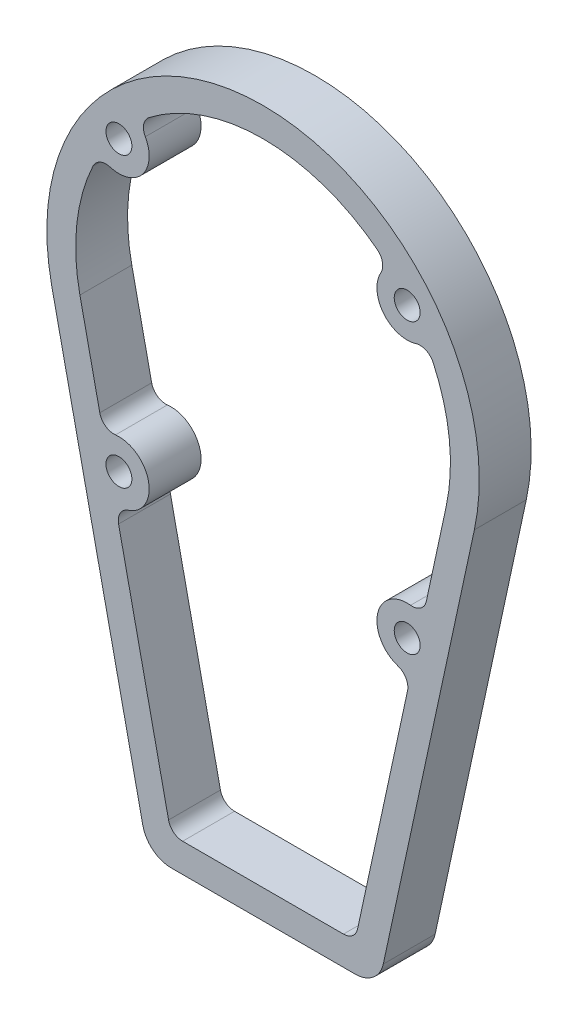
ISO-10303-21;
HEADER;
FILE_DESCRIPTION(('STEP AP214'),'2;1');
FILE_NAME('part.step','',(''),(''),'','','');
FILE_SCHEMA(('AUTOMOTIVE_DESIGN { 1 0 10303 214 1 1 1 1 }'));
ENDSEC;
DATA;
#1=APPLICATION_CONTEXT('core data for automotive mechanical design processes');
#2=APPLICATION_PROTOCOL_DEFINITION('international standard','automotive_design',2000,#1);
#3=PRODUCT_CONTEXT('',#1,'mechanical');
#4=PRODUCT('Part','Part','',(#3));
#5=PRODUCT_RELATED_PRODUCT_CATEGORY('part','',(#4));
#6=PRODUCT_DEFINITION_FORMATION('','',#4);
#7=PRODUCT_DEFINITION_CONTEXT('part definition',#1,'design');
#8=PRODUCT_DEFINITION('design','',#6,#7);
#9=PRODUCT_DEFINITION_SHAPE('','',#8);
#10=(LENGTH_UNIT() NAMED_UNIT(*) SI_UNIT(.MILLI.,.METRE.));
#11=(NAMED_UNIT(*) PLANE_ANGLE_UNIT() SI_UNIT($,.RADIAN.));
#12=(NAMED_UNIT(*) SI_UNIT($,.STERADIAN.) SOLID_ANGLE_UNIT());
#13=UNCERTAINTY_MEASURE_WITH_UNIT(LENGTH_MEASURE(1.E-05),#10,'distance_accuracy_value','');
#14=(GEOMETRIC_REPRESENTATION_CONTEXT(3) GLOBAL_UNCERTAINTY_ASSIGNED_CONTEXT((#13)) GLOBAL_UNIT_ASSIGNED_CONTEXT((#10,
#11,#12)) REPRESENTATION_CONTEXT('',''));
#15=CARTESIAN_POINT('',(0.,0.,0.));
#16=DIRECTION('',(0.,0.,1.));
#17=DIRECTION('',(1.,0.,0.));
#18=AXIS2_PLACEMENT_3D('',#15,#16,#17);
#19=CARTESIAN_POINT('',(0.,47.5,0.));
#20=DIRECTION('',(0.,0.,1.));
#21=DIRECTION('',(1.,0.,0.));
#22=AXIS2_PLACEMENT_3D('',#19,#20,#21);
#23=CYLINDRICAL_SURFACE('',#22,75.);
#24=CARTESIAN_POINT('',(0.,47.5,18.));
#25=DIRECTION('',(0.,0.,1.));
#26=DIRECTION('',(1.,0.,0.));
#27=AXIS2_PLACEMENT_3D('',#24,#25,#26);
#28=CIRCLE('',#27,75.);
#29=CARTESIAN_POINT('',(73.3083873012265,31.6607970120533,18.));
#30=VERTEX_POINT('',#29);
#31=CARTESIAN_POINT('',(-73.3083873012264,31.6607970120533,18.));
#32=VERTEX_POINT('',#31);
#33=EDGE_CURVE('E363',#30,#32,#28,.T.);
#34=ORIENTED_EDGE('',*,*,#33,.F.);
#35=DIRECTION('',(0.,0.,1.));
#36=VECTOR('',#35,1.);
#37=CARTESIAN_POINT('',(73.3083873012265,31.6607970120533,0.));
#38=LINE('',#37,#36);
#39=CARTESIAN_POINT('',(73.3083873012265,31.6607970120533,0.));
#40=VERTEX_POINT('',#39);
#41=EDGE_CURVE('E11',#40,#30,#38,.T.);
#42=ORIENTED_EDGE('',*,*,#41,.F.);
#43=CARTESIAN_POINT('',(0.,47.5,0.));
#44=DIRECTION('',(0.,0.,1.));
#45=DIRECTION('',(1.,0.,0.));
#46=AXIS2_PLACEMENT_3D('',#43,#44,#45);
#47=CIRCLE('',#46,75.);
#48=CARTESIAN_POINT('',(-73.3083873012264,31.6607970120533,0.));
#49=VERTEX_POINT('',#48);
#50=EDGE_CURVE('E403',#40,#49,#47,.T.);
#51=ORIENTED_EDGE('',*,*,#50,.T.);
#52=DIRECTION('',(0.,0.,1.));
#53=VECTOR('',#52,1.);
#54=CARTESIAN_POINT('',(-73.3083873012264,31.6607970120533,0.));
#55=LINE('',#54,#53);
#56=EDGE_CURVE('E36',#49,#32,#55,.T.);
#57=ORIENTED_EDGE('',*,*,#56,.T.);
#58=EDGE_LOOP('',(#34,#42,#51,#57));
#59=FACE_BOUND('',#58,.T.);
#60=ADVANCED_FACE('F33',(#59),#23,.T.);
#61=CARTESIAN_POINT('',(41.7043249889033,-114.611893731726,0.));
#62=DIRECTION('',(0.977445164016353,-0.211189373172623,0.));
#63=DIRECTION('',(0.211189373172623,0.977445164016353,0.));
#64=AXIS2_PLACEMENT_3D('',#61,#62,#63);
#65=PLANE('',#64);
#66=DIRECTION('',(0.211189373172623,0.977445164016353,0.));
#67=VECTOR('',#66,1.);
#68=CARTESIAN_POINT('',(41.7043249889033,-114.611893731726,18.));
#69=LINE('',#68,#67);
#70=CARTESIAN_POINT('',(41.7043249889033,-114.611893731726,18.));
#71=VERTEX_POINT('',#70);
#72=EDGE_CURVE('E407',#71,#30,#69,.T.);
#73=ORIENTED_EDGE('',*,*,#72,.F.);
#74=DIRECTION('',(0.,0.,1.));
#75=VECTOR('',#74,1.);
#76=CARTESIAN_POINT('',(41.7043249889033,-114.611893731726,0.));
#77=LINE('',#76,#75);
#78=CARTESIAN_POINT('',(41.7043249889033,-114.611893731726,0.));
#79=VERTEX_POINT('',#78);
#80=EDGE_CURVE('E41',#79,#71,#77,.T.);
#81=ORIENTED_EDGE('',*,*,#80,.F.);
#82=DIRECTION('',(0.211189373172623,0.977445164016353,0.));
#83=VECTOR('',#82,1.);
#84=CARTESIAN_POINT('',(41.7043249889033,-114.611893731726,0.));
#85=LINE('',#84,#83);
#86=EDGE_CURVE('E419',#79,#40,#85,.T.);
#87=ORIENTED_EDGE('',*,*,#86,.T.);
#88=ORIENTED_EDGE('',*,*,#41,.T.);
#89=EDGE_LOOP('',(#73,#81,#87,#88));
#90=FACE_BOUND('',#89,.T.);
#91=ADVANCED_FACE('F456',(#90),#65,.T.);
#92=CARTESIAN_POINT('',(31.9298733487398,-112.5,0.));
#93=DIRECTION('',(0.,0.,1.));
#94=DIRECTION('',(1.,0.,0.));
#95=AXIS2_PLACEMENT_3D('',#92,#93,#94);
#96=CYLINDRICAL_SURFACE('',#95,10.);
#97=CARTESIAN_POINT('',(31.9298733487398,-112.5,18.));
#98=DIRECTION('',(0.,0.,1.));
#99=DIRECTION('',(1.,0.,0.));
#100=AXIS2_PLACEMENT_3D('',#97,#98,#99);
#101=CIRCLE('',#100,10.);
#102=CARTESIAN_POINT('',(31.9298733487398,-122.5,18.));
#103=VERTEX_POINT('',#102);
#104=EDGE_CURVE('E433',#103,#71,#101,.T.);
#105=ORIENTED_EDGE('',*,*,#104,.F.);
#106=DIRECTION('',(0.,0.,1.));
#107=VECTOR('',#106,1.);
#108=CARTESIAN_POINT('',(31.9298733487398,-122.5,0.));
#109=LINE('',#108,#107);
#110=CARTESIAN_POINT('',(31.9298733487398,-122.5,0.));
#111=VERTEX_POINT('',#110);
#112=EDGE_CURVE('E439',#111,#103,#109,.T.);
#113=ORIENTED_EDGE('',*,*,#112,.F.);
#114=CARTESIAN_POINT('',(31.9298733487398,-112.5,0.));
#115=DIRECTION('',(0.,0.,1.));
#116=DIRECTION('',(1.,0.,0.));
#117=AXIS2_PLACEMENT_3D('',#114,#115,#116);
#118=CIRCLE('',#117,10.);
#119=EDGE_CURVE('E416',#111,#79,#118,.T.);
#120=ORIENTED_EDGE('',*,*,#119,.T.);
#121=ORIENTED_EDGE('',*,*,#80,.T.);
#122=EDGE_LOOP('',(#105,#113,#120,#121));
#123=FACE_BOUND('',#122,.T.);
#124=ADVANCED_FACE('F467',(#123),#96,.T.);
#125=CARTESIAN_POINT('',(-31.9298733487398,-122.5,0.));
#126=DIRECTION('',(0.,-1.,0.));
#127=DIRECTION('',(0.,0.,-1.));
#128=AXIS2_PLACEMENT_3D('',#125,#126,#127);
#129=PLANE('',#128);
#130=DIRECTION('',(1.,0.,0.));
#131=VECTOR('',#130,1.);
#132=CARTESIAN_POINT('',(-31.9298733487398,-122.5,18.));
#133=LINE('',#132,#131);
#134=CARTESIAN_POINT('',(-31.9298733487398,-122.5,18.));
#135=VERTEX_POINT('',#134);
#136=EDGE_CURVE('E430',#135,#103,#133,.T.);
#137=ORIENTED_EDGE('',*,*,#136,.F.);
#138=DIRECTION('',(0.,0.,1.));
#139=VECTOR('',#138,1.);
#140=CARTESIAN_POINT('',(-31.9298733487398,-122.5,0.));
#141=LINE('',#140,#139);
#142=CARTESIAN_POINT('',(-31.9298733487398,-122.5,0.));
#143=VERTEX_POINT('',#142);
#144=EDGE_CURVE('E441',#143,#135,#141,.T.);
#145=ORIENTED_EDGE('',*,*,#144,.F.);
#146=DIRECTION('',(1.,0.,0.));
#147=VECTOR('',#146,1.);
#148=CARTESIAN_POINT('',(-31.9298733487398,-122.5,0.));
#149=LINE('',#148,#147);
#150=EDGE_CURVE('E413',#143,#111,#149,.T.);
#151=ORIENTED_EDGE('',*,*,#150,.T.);
#152=ORIENTED_EDGE('',*,*,#112,.T.);
#153=EDGE_LOOP('',(#137,#145,#151,#152));
#154=FACE_BOUND('',#153,.T.);
#155=ADVANCED_FACE('F465',(#154),#129,.T.);
#156=CARTESIAN_POINT('',(-31.9298733487398,-112.5,0.));
#157=DIRECTION('',(0.,0.,1.));
#158=DIRECTION('',(1.,0.,0.));
#159=AXIS2_PLACEMENT_3D('',#156,#157,#158);
#160=CYLINDRICAL_SURFACE('',#159,10.);
#161=CARTESIAN_POINT('',(-31.9298733487398,-112.5,18.));
#162=DIRECTION('',(0.,0.,1.));
#163=DIRECTION('',(1.,0.,0.));
#164=AXIS2_PLACEMENT_3D('',#161,#162,#163);
#165=CIRCLE('',#164,10.);
#166=CARTESIAN_POINT('',(-41.7043249889034,-114.611893731726,18.));
#167=VERTEX_POINT('',#166);
#168=EDGE_CURVE('E427',#167,#135,#165,.T.);
#169=ORIENTED_EDGE('',*,*,#168,.F.);
#170=DIRECTION('',(0.,0.,1.));
#171=VECTOR('',#170,1.);
#172=CARTESIAN_POINT('',(-41.7043249889034,-114.611893731726,0.));
#173=LINE('',#172,#171);
#174=CARTESIAN_POINT('',(-41.7043249889034,-114.611893731726,0.));
#175=VERTEX_POINT('',#174);
#176=EDGE_CURVE('E442',#175,#167,#173,.T.);
#177=ORIENTED_EDGE('',*,*,#176,.F.);
#178=CARTESIAN_POINT('',(-31.9298733487398,-112.5,0.));
#179=DIRECTION('',(0.,0.,1.));
#180=DIRECTION('',(1.,0.,0.));
#181=AXIS2_PLACEMENT_3D('',#178,#179,#180);
#182=CIRCLE('',#181,10.);
#183=EDGE_CURVE('E410',#175,#143,#182,.T.);
#184=ORIENTED_EDGE('',*,*,#183,.T.);
#185=ORIENTED_EDGE('',*,*,#144,.T.);
#186=EDGE_LOOP('',(#169,#177,#184,#185));
#187=FACE_BOUND('',#186,.T.);
#188=ADVANCED_FACE('F462',(#187),#160,.T.);
#189=CARTESIAN_POINT('',(-73.3083873012264,31.6607970120533,0.));
#190=DIRECTION('',(-0.977445164016353,-0.211189373172623,0.));
#191=DIRECTION('',(0.211189373172623,-0.977445164016353,0.));
#192=AXIS2_PLACEMENT_3D('',#189,#190,#191);
#193=PLANE('',#192);
#194=DIRECTION('',(0.211189373172623,-0.977445164016353,0.));
#195=VECTOR('',#194,1.);
#196=CARTESIAN_POINT('',(-73.3083873012264,31.6607970120533,18.));
#197=LINE('',#196,#195);
#198=EDGE_CURVE('E424',#32,#167,#197,.T.);
#199=ORIENTED_EDGE('',*,*,#198,.F.);
#200=ORIENTED_EDGE('',*,*,#56,.F.);
#201=DIRECTION('',(0.211189373172623,-0.977445164016353,0.));
#202=VECTOR('',#201,1.);
#203=CARTESIAN_POINT('',(-73.3083873012264,31.6607970120533,0.));
#204=LINE('',#203,#202);
#205=EDGE_CURVE('E406',#49,#175,#204,.T.);
#206=ORIENTED_EDGE('',*,*,#205,.T.);
#207=ORIENTED_EDGE('',*,*,#176,.T.);
#208=EDGE_LOOP('',(#199,#200,#206,#207));
#209=FACE_BOUND('',#208,.T.);
#210=ADVANCED_FACE('F450',(#209),#193,.T.);
#211=CARTESIAN_POINT('',(0.,47.5,0.));
#212=DIRECTION('',(0.,0.,1.));
#213=DIRECTION('',(1.,0.,0.));
#214=AXIS2_PLACEMENT_3D('',#211,#212,#213);
#215=PLANE('',#214);
#216=CARTESIAN_POINT('',(-50.,87.5,0.));
#217=DIRECTION('',(0.,0.,1.));
#218=DIRECTION('',(-1.,0.,0.));
#219=AXIS2_PLACEMENT_3D('',#216,#217,#218);
#220=CIRCLE('',#219,4.5);
#221=CARTESIAN_POINT('',(-54.5,87.5,0.));
#222=VERTEX_POINT('',#221);
#223=EDGE_CURVE('E788',#222,#222,#220,.T.);
#224=ORIENTED_EDGE('',*,*,#223,.T.);
#225=EDGE_LOOP('',(#224));
#226=FACE_BOUND('',#225,.T.);
#227=CARTESIAN_POINT('',(50.,-12.5,0.));
#228=DIRECTION('',(0.,0.,1.));
#229=DIRECTION('',(-1.,0.,0.));
#230=AXIS2_PLACEMENT_3D('',#227,#228,#229);
#231=CIRCLE('',#230,4.5);
#232=CARTESIAN_POINT('',(45.5,-12.5,0.));
#233=VERTEX_POINT('',#232);
#234=EDGE_CURVE('E796',#233,#233,#231,.T.);
#235=ORIENTED_EDGE('',*,*,#234,.T.);
#236=EDGE_LOOP('',(#235));
#237=FACE_BOUND('',#236,.T.);
#238=CARTESIAN_POINT('',(50.,87.5,0.));
#239=DIRECTION('',(0.,0.,1.));
#240=DIRECTION('',(-1.,0.,0.));
#241=AXIS2_PLACEMENT_3D('',#238,#239,#240);
#242=CIRCLE('',#241,4.5);
#243=CARTESIAN_POINT('',(45.5,87.5,0.));
#244=VERTEX_POINT('',#243);
#245=EDGE_CURVE('E802',#244,#244,#242,.T.);
#246=ORIENTED_EDGE('',*,*,#245,.T.);
#247=EDGE_LOOP('',(#246));
#248=FACE_BOUND('',#247,.T.);
#249=CARTESIAN_POINT('',(-50.,-12.5,0.));
#250=DIRECTION('',(0.,0.,1.));
#251=DIRECTION('',(-1.,0.,0.));
#252=AXIS2_PLACEMENT_3D('',#249,#250,#251);
#253=CIRCLE('',#252,4.5);
#254=CARTESIAN_POINT('',(-54.5,-12.5,0.));
#255=VERTEX_POINT('',#254);
#256=EDGE_CURVE('E303',#255,#255,#253,.T.);
#257=ORIENTED_EDGE('',*,*,#256,.T.);
#258=EDGE_LOOP('',(#257));
#259=FACE_BOUND('',#258,.T.);
#260=CARTESIAN_POINT('',(54.470541876852,72.6586976539351,0.));
#261=DIRECTION('',(0.,0.,1.));
#262=DIRECTION('',(-1.,0.,0.));
#263=AXIS2_PLACEMENT_3D('',#260,#261,#262);
#264=CIRCLE('',#263,5.00000000000001);
#265=CARTESIAN_POINT('',(59.009753699923,74.755255791763,0.));
#266=VERTEX_POINT('',#265);
#267=CARTESIAN_POINT('',(53.0284315939965,77.4462145397625,0.));
#268=VERTEX_POINT('',#267);
#269=EDGE_CURVE('E226',#266,#268,#264,.T.);
#270=ORIENTED_EDGE('',*,*,#269,.T.);
#271=CARTESIAN_POINT('',(50.,87.5,0.));
#272=DIRECTION('',(0.,0.,-1.));
#273=DIRECTION('',(1.,0.,0.));
#274=AXIS2_PLACEMENT_3D('',#271,#272,#273);
#275=CIRCLE('',#274,10.5);
#276=CARTESIAN_POINT('',(40.8562064862553,92.6614959244389,0.));
#277=VERTEX_POINT('',#276);
#278=EDGE_CURVE('E220',#268,#277,#275,.T.);
#279=ORIENTED_EDGE('',*,*,#278,.T.);
#280=CARTESIAN_POINT('',(36.5020190987578,95.1193511265527,0.));
#281=DIRECTION('',(0.,0.,1.));
#282=DIRECTION('',(-1.,0.,0.));
#283=AXIS2_PLACEMENT_3D('',#280,#281,#282);
#284=CIRCLE('',#283,5.);
#285=CARTESIAN_POINT('',(39.5438540236543,99.0876303870988,0.));
#286=VERTEX_POINT('',#285);
#287=EDGE_CURVE('E229',#277,#286,#284,.T.);
#288=ORIENTED_EDGE('',*,*,#287,.T.);
#289=CARTESIAN_POINT('',(0.,47.5,0.));
#290=DIRECTION('',(0.,0.,1.));
#291=DIRECTION('',(-1.,0.,0.));
#292=AXIS2_PLACEMENT_3D('',#289,#290,#291);
#293=CIRCLE('',#292,65.);
#294=CARTESIAN_POINT('',(-39.5438540236543,99.0876303870988,0.));
#295=VERTEX_POINT('',#294);
#296=EDGE_CURVE('E49',#286,#295,#293,.T.);
#297=ORIENTED_EDGE('',*,*,#296,.T.);
#298=CARTESIAN_POINT('',(-36.5020190987578,95.1193511265528,0.));
#299=DIRECTION('',(0.,0.,1.));
#300=DIRECTION('',(-1.,0.,0.));
#301=AXIS2_PLACEMENT_3D('',#298,#299,#300);
#302=CIRCLE('',#301,5.);
#303=CARTESIAN_POINT('',(-40.8562064862553,92.661495924439,0.));
#304=VERTEX_POINT('',#303);
#305=EDGE_CURVE('E247',#295,#304,#302,.T.);
#306=ORIENTED_EDGE('',*,*,#305,.T.);
#307=CARTESIAN_POINT('',(-50.,87.5,0.));
#308=DIRECTION('',(0.,0.,-1.));
#309=DIRECTION('',(1.,0.,0.));
#310=AXIS2_PLACEMENT_3D('',#307,#308,#309);
#311=CIRCLE('',#310,10.5);
#312=CARTESIAN_POINT('',(-53.0284315939965,77.4462145397625,0.));
#313=VERTEX_POINT('',#312);
#314=EDGE_CURVE('E250',#304,#313,#311,.T.);
#315=ORIENTED_EDGE('',*,*,#314,.T.);
#316=CARTESIAN_POINT('',(-54.4705418768519,72.6586976539351,0.));
#317=DIRECTION('',(0.,0.,1.));
#318=DIRECTION('',(-1.,0.,0.));
#319=AXIS2_PLACEMENT_3D('',#316,#317,#318);
#320=CIRCLE('',#319,5.00000000000001);
#321=CARTESIAN_POINT('',(-59.009753699923,74.755255791763,0.));
#322=VERTEX_POINT('',#321);
#323=EDGE_CURVE('E253',#313,#322,#320,.T.);
#324=ORIENTED_EDGE('',*,*,#323,.T.);
#325=CARTESIAN_POINT('',(0.,47.5,0.));
#326=DIRECTION('',(0.,0.,1.));
#327=DIRECTION('',(-1.,0.,0.));
#328=AXIS2_PLACEMENT_3D('',#325,#326,#327);
#329=CIRCLE('',#328,65.);
#330=CARTESIAN_POINT('',(-63.5339356610629,33.7726907437795,0.));
#331=VERTEX_POINT('',#330);
#332=EDGE_CURVE('E256',#322,#331,#329,.T.);
#333=ORIENTED_EDGE('',*,*,#332,.T.);
#334=DIRECTION('',(0.211189373172623,-0.977445164016353,0.));
#335=VECTOR('',#334,1.);
#336=CARTESIAN_POINT('',(-56.63558344571,1.84513249932773,0.));
#337=LINE('',#336,#335);
#338=CARTESIAN_POINT('',(-56.63558344571,1.84513249932773,0.));
#339=VERTEX_POINT('',#338);
#340=EDGE_CURVE('E259',#331,#339,#337,.T.);
#341=ORIENTED_EDGE('',*,*,#340,.T.);
#342=CARTESIAN_POINT('',(-51.7483576256283,2.90107936519085,0.));
#343=DIRECTION('',(0.,0.,1.));
#344=DIRECTION('',(-1.,0.,0.));
#345=AXIS2_PLACEMENT_3D('',#342,#343,#344);
#346=CIRCLE('',#345,5.);
#347=CARTESIAN_POINT('',(-51.1843712947804,-2.06701075261265,0.));
#348=VERTEX_POINT('',#347);
#349=EDGE_CURVE('E262',#339,#348,#346,.T.);
#350=ORIENTED_EDGE('',*,*,#349,.T.);
#351=CARTESIAN_POINT('',(-50.,-12.5,0.));
#352=DIRECTION('',(0.,0.,-1.));
#353=DIRECTION('',(1.,0.,0.));
#354=AXIS2_PLACEMENT_3D('',#351,#352,#353);
#355=CIRCLE('',#354,10.5);
#356=CARTESIAN_POINT('',(-46.7714419877795,-22.4913168882649,0.));
#357=VERTEX_POINT('',#356);
#358=EDGE_CURVE('E265',#348,#357,#355,.T.);
#359=ORIENTED_EDGE('',*,*,#358,.T.);
#360=CARTESIAN_POINT('',(-45.2340334105316,-27.2490868350576,0.));
#361=DIRECTION('',(0.,0.,1.));
#362=DIRECTION('',(-1.,0.,0.));
#363=AXIS2_PLACEMENT_3D('',#360,#361,#362);
#364=CIRCLE('',#363,5.);
#365=CARTESIAN_POINT('',(-50.1212592306134,-28.3050337009208,0.));
#366=VERTEX_POINT('',#365);
#367=EDGE_CURVE('E268',#357,#366,#364,.T.);
#368=ORIENTED_EDGE('',*,*,#367,.T.);
#369=DIRECTION('',(0.211189373172623,-0.977445164016353,0.));
#370=VECTOR('',#369,1.);
#371=CARTESIAN_POINT('',(-32.7820358431915,-108.555946865863,0.));
#372=LINE('',#371,#370);
#373=CARTESIAN_POINT('',(-32.7820358431915,-108.555946865863,0.));
#374=VERTEX_POINT('',#373);
#375=EDGE_CURVE('E271',#366,#374,#372,.T.);
#376=ORIENTED_EDGE('',*,*,#375,.T.);
#377=CARTESIAN_POINT('',(-27.8948100231097,-107.5,0.));
#378=DIRECTION('',(0.,0.,1.));
#379=DIRECTION('',(-1.,0.,0.));
#380=AXIS2_PLACEMENT_3D('',#377,#378,#379);
#381=CIRCLE('',#380,5.);
#382=CARTESIAN_POINT('',(-27.8948100231097,-112.5,0.));
#383=VERTEX_POINT('',#382);
#384=EDGE_CURVE('E274',#374,#383,#381,.T.);
#385=ORIENTED_EDGE('',*,*,#384,.T.);
#386=DIRECTION('',(1.,0.,0.));
#387=VECTOR('',#386,1.);
#388=CARTESIAN_POINT('',(27.8948100231097,-112.5,0.));
#389=LINE('',#388,#387);
#390=CARTESIAN_POINT('',(27.8948100231097,-112.5,0.));
#391=VERTEX_POINT('',#390);
#392=EDGE_CURVE('E277',#383,#391,#389,.T.);
#393=ORIENTED_EDGE('',*,*,#392,.T.);
#394=CARTESIAN_POINT('',(27.8948100231097,-107.5,0.));
#395=DIRECTION('',(0.,0.,1.));
#396=DIRECTION('',(-1.,0.,0.));
#397=AXIS2_PLACEMENT_3D('',#394,#395,#396);
#398=CIRCLE('',#397,5.00000000000001);
#399=CARTESIAN_POINT('',(32.7820358431914,-108.555946865863,0.));
#400=VERTEX_POINT('',#399);
#401=EDGE_CURVE('E280',#391,#400,#398,.T.);
#402=ORIENTED_EDGE('',*,*,#401,.T.);
#403=DIRECTION('',(0.211189373172623,0.977445164016353,0.));
#404=VECTOR('',#403,1.);
#405=CARTESIAN_POINT('',(50.1212592306133,-28.3050337009207,0.));
#406=LINE('',#405,#404);
#407=CARTESIAN_POINT('',(50.1212592306133,-28.3050337009207,0.));
#408=VERTEX_POINT('',#407);
#409=EDGE_CURVE('E283',#400,#408,#406,.T.);
#410=ORIENTED_EDGE('',*,*,#409,.T.);
#411=CARTESIAN_POINT('',(45.2340334105316,-27.2490868350576,0.));
#412=DIRECTION('',(0.,0.,1.));
#413=DIRECTION('',(-1.,0.,0.));
#414=AXIS2_PLACEMENT_3D('',#411,#412,#413);
#415=CIRCLE('',#414,5.00000000000001);
#416=CARTESIAN_POINT('',(46.7714419877794,-22.4913168882648,0.));
#417=VERTEX_POINT('',#416);
#418=EDGE_CURVE('E286',#408,#417,#415,.T.);
#419=ORIENTED_EDGE('',*,*,#418,.T.);
#420=CARTESIAN_POINT('',(50.,-12.5,0.));
#421=DIRECTION('',(0.,0.,-1.));
#422=DIRECTION('',(1.,0.,0.));
#423=AXIS2_PLACEMENT_3D('',#420,#421,#422);
#424=CIRCLE('',#423,10.5);
#425=CARTESIAN_POINT('',(51.1843712947804,-2.06701075261265,0.));
#426=VERTEX_POINT('',#425);
#427=EDGE_CURVE('E289',#417,#426,#424,.T.);
#428=ORIENTED_EDGE('',*,*,#427,.T.);
#429=CARTESIAN_POINT('',(51.7483576256282,2.90107936519085,0.));
#430=DIRECTION('',(0.,0.,1.));
#431=DIRECTION('',(-1.,0.,0.));
#432=AXIS2_PLACEMENT_3D('',#429,#430,#431);
#433=CIRCLE('',#432,5.);
#434=CARTESIAN_POINT('',(56.63558344571,1.84513249932774,0.));
#435=VERTEX_POINT('',#434);
#436=EDGE_CURVE('E292',#426,#435,#433,.T.);
#437=ORIENTED_EDGE('',*,*,#436,.T.);
#438=DIRECTION('',(0.211189373172623,0.977445164016353,0.));
#439=VECTOR('',#438,1.);
#440=CARTESIAN_POINT('',(63.5339356610629,33.7726907437795,0.));
#441=LINE('',#440,#439);
#442=CARTESIAN_POINT('',(63.5339356610629,33.7726907437795,0.));
#443=VERTEX_POINT('',#442);
#444=EDGE_CURVE('E295',#435,#443,#441,.T.);
#445=ORIENTED_EDGE('',*,*,#444,.T.);
#446=CARTESIAN_POINT('',(0.,47.5,0.));
#447=DIRECTION('',(0.,0.,1.));
#448=DIRECTION('',(-1.,0.,0.));
#449=AXIS2_PLACEMENT_3D('',#446,#447,#448);
#450=CIRCLE('',#449,65.);
#451=EDGE_CURVE('E298',#443,#266,#450,.T.);
#452=ORIENTED_EDGE('',*,*,#451,.T.);
#453=EDGE_LOOP('',(#270,#279,#288,#297,#306,#315,#324,#333,#341,#350,#359,#368,#376,#385,#393,
#402,#410,#419,#428,#437,#445,#452));
#454=FACE_BOUND('',#453,.T.);
#455=ORIENTED_EDGE('',*,*,#50,.F.);
#456=ORIENTED_EDGE('',*,*,#86,.F.);
#457=ORIENTED_EDGE('',*,*,#119,.F.);
#458=ORIENTED_EDGE('',*,*,#150,.F.);
#459=ORIENTED_EDGE('',*,*,#183,.F.);
#460=ORIENTED_EDGE('',*,*,#205,.F.);
#461=EDGE_LOOP('',(#455,#456,#457,#458,#459,#460));
#462=FACE_BOUND('',#461,.T.);
#463=ADVANCED_FACE('F233',(#226,#237,#248,#259,#454,#462),#215,.F.);
#464=CARTESIAN_POINT('',(0.,47.5,18.));
#465=DIRECTION('',(0.,0.,1.));
#466=DIRECTION('',(1.,0.,0.));
#467=AXIS2_PLACEMENT_3D('',#464,#465,#466);
#468=PLANE('',#467);
#469=CARTESIAN_POINT('',(-50.,87.5,18.));
#470=DIRECTION('',(0.,0.,1.));
#471=DIRECTION('',(-1.,0.,0.));
#472=AXIS2_PLACEMENT_3D('',#469,#470,#471);
#473=CIRCLE('',#472,4.5);
#474=CARTESIAN_POINT('',(-54.5,87.5,18.));
#475=VERTEX_POINT('',#474);
#476=EDGE_CURVE('E791',#475,#475,#473,.T.);
#477=ORIENTED_EDGE('',*,*,#476,.F.);
#478=EDGE_LOOP('',(#477));
#479=FACE_BOUND('',#478,.T.);
#480=CARTESIAN_POINT('',(50.,-12.5,18.));
#481=DIRECTION('',(0.,0.,1.));
#482=DIRECTION('',(-1.,0.,0.));
#483=AXIS2_PLACEMENT_3D('',#480,#481,#482);
#484=CIRCLE('',#483,4.5);
#485=CARTESIAN_POINT('',(45.5,-12.5,18.));
#486=VERTEX_POINT('',#485);
#487=EDGE_CURVE('E793',#486,#486,#484,.T.);
#488=ORIENTED_EDGE('',*,*,#487,.F.);
#489=EDGE_LOOP('',(#488));
#490=FACE_BOUND('',#489,.T.);
#491=CARTESIAN_POINT('',(50.,87.5,18.));
#492=DIRECTION('',(0.,0.,1.));
#493=DIRECTION('',(-1.,0.,0.));
#494=AXIS2_PLACEMENT_3D('',#491,#492,#493);
#495=CIRCLE('',#494,4.5);
#496=CARTESIAN_POINT('',(45.5,87.5,18.));
#497=VERTEX_POINT('',#496);
#498=EDGE_CURVE('E799',#497,#497,#495,.T.);
#499=ORIENTED_EDGE('',*,*,#498,.F.);
#500=EDGE_LOOP('',(#499));
#501=FACE_BOUND('',#500,.T.);
#502=CARTESIAN_POINT('',(-50.,-12.5,18.));
#503=DIRECTION('',(0.,0.,1.));
#504=DIRECTION('',(-1.,0.,0.));
#505=AXIS2_PLACEMENT_3D('',#502,#503,#504);
#506=CIRCLE('',#505,4.5);
#507=CARTESIAN_POINT('',(-54.5,-12.5,18.));
#508=VERTEX_POINT('',#507);
#509=EDGE_CURVE('E243',#508,#508,#506,.T.);
#510=ORIENTED_EDGE('',*,*,#509,.F.);
#511=EDGE_LOOP('',(#510));
#512=FACE_BOUND('',#511,.T.);
#513=CARTESIAN_POINT('',(50.,87.5,18.));
#514=DIRECTION('',(0.,0.,-1.));
#515=DIRECTION('',(1.,0.,0.));
#516=AXIS2_PLACEMENT_3D('',#513,#514,#515);
#517=CIRCLE('',#516,10.5);
#518=CARTESIAN_POINT('',(53.0284315939965,77.4462145397625,18.));
#519=VERTEX_POINT('',#518);
#520=CARTESIAN_POINT('',(40.8562064862553,92.6614959244389,18.));
#521=VERTEX_POINT('',#520);
#522=EDGE_CURVE('E57',#519,#521,#517,.T.);
#523=ORIENTED_EDGE('',*,*,#522,.F.);
#524=CARTESIAN_POINT('',(54.470541876852,72.6586976539351,18.));
#525=DIRECTION('',(0.,0.,1.));
#526=DIRECTION('',(-1.,0.,0.));
#527=AXIS2_PLACEMENT_3D('',#524,#525,#526);
#528=CIRCLE('',#527,5.00000000000001);
#529=CARTESIAN_POINT('',(59.009753699923,74.755255791763,18.));
#530=VERTEX_POINT('',#529);
#531=EDGE_CURVE('E237',#530,#519,#528,.T.);
#532=ORIENTED_EDGE('',*,*,#531,.F.);
#533=CARTESIAN_POINT('',(0.,47.5,18.));
#534=DIRECTION('',(0.,0.,1.));
#535=DIRECTION('',(-1.,0.,0.));
#536=AXIS2_PLACEMENT_3D('',#533,#534,#535);
#537=CIRCLE('',#536,65.);
#538=CARTESIAN_POINT('',(63.5339356610629,33.7726907437795,18.));
#539=VERTEX_POINT('',#538);
#540=EDGE_CURVE('E240',#539,#530,#537,.T.);
#541=ORIENTED_EDGE('',*,*,#540,.F.);
#542=DIRECTION('',(0.211189373172623,0.977445164016353,0.));
#543=VECTOR('',#542,1.);
#544=CARTESIAN_POINT('',(63.5339356610629,33.7726907437795,18.));
#545=LINE('',#544,#543);
#546=CARTESIAN_POINT('',(56.63558344571,1.84513249932774,18.));
#547=VERTEX_POINT('',#546);
#548=EDGE_CURVE('E356',#547,#539,#545,.T.);
#549=ORIENTED_EDGE('',*,*,#548,.F.);
#550=CARTESIAN_POINT('',(51.7483576256282,2.90107936519085,18.));
#551=DIRECTION('',(0.,0.,1.));
#552=DIRECTION('',(-1.,0.,0.));
#553=AXIS2_PLACEMENT_3D('',#550,#551,#552);
#554=CIRCLE('',#553,5.);
#555=CARTESIAN_POINT('',(51.1843712947804,-2.06701075261265,18.));
#556=VERTEX_POINT('',#555);
#557=EDGE_CURVE('E353',#556,#547,#554,.T.);
#558=ORIENTED_EDGE('',*,*,#557,.F.);
#559=CARTESIAN_POINT('',(50.,-12.5,18.));
#560=DIRECTION('',(0.,0.,-1.));
#561=DIRECTION('',(1.,0.,0.));
#562=AXIS2_PLACEMENT_3D('',#559,#560,#561);
#563=CIRCLE('',#562,10.5);
#564=CARTESIAN_POINT('',(46.7714419877794,-22.4913168882648,18.));
#565=VERTEX_POINT('',#564);
#566=EDGE_CURVE('E350',#565,#556,#563,.T.);
#567=ORIENTED_EDGE('',*,*,#566,.F.);
#568=CARTESIAN_POINT('',(45.2340334105316,-27.2490868350576,18.));
#569=DIRECTION('',(0.,0.,1.));
#570=DIRECTION('',(-1.,0.,0.));
#571=AXIS2_PLACEMENT_3D('',#568,#569,#570);
#572=CIRCLE('',#571,5.00000000000001);
#573=CARTESIAN_POINT('',(50.1212592306133,-28.3050337009207,18.));
#574=VERTEX_POINT('',#573);
#575=EDGE_CURVE('E347',#574,#565,#572,.T.);
#576=ORIENTED_EDGE('',*,*,#575,.F.);
#577=DIRECTION('',(0.211189373172623,0.977445164016353,0.));
#578=VECTOR('',#577,1.);
#579=CARTESIAN_POINT('',(50.1212592306133,-28.3050337009207,18.));
#580=LINE('',#579,#578);
#581=CARTESIAN_POINT('',(32.7820358431914,-108.555946865863,18.));
#582=VERTEX_POINT('',#581);
#583=EDGE_CURVE('E344',#582,#574,#580,.T.);
#584=ORIENTED_EDGE('',*,*,#583,.F.);
#585=CARTESIAN_POINT('',(27.8948100231097,-107.5,18.));
#586=DIRECTION('',(0.,0.,1.));
#587=DIRECTION('',(-1.,0.,0.));
#588=AXIS2_PLACEMENT_3D('',#585,#586,#587);
#589=CIRCLE('',#588,5.00000000000001);
#590=CARTESIAN_POINT('',(27.8948100231097,-112.5,18.));
#591=VERTEX_POINT('',#590);
#592=EDGE_CURVE('E341',#591,#582,#589,.T.);
#593=ORIENTED_EDGE('',*,*,#592,.F.);
#594=DIRECTION('',(1.,0.,0.));
#595=VECTOR('',#594,1.);
#596=CARTESIAN_POINT('',(27.8948100231097,-112.5,18.));
#597=LINE('',#596,#595);
#598=CARTESIAN_POINT('',(-27.8948100231097,-112.5,18.));
#599=VERTEX_POINT('',#598);
#600=EDGE_CURVE('E338',#599,#591,#597,.T.);
#601=ORIENTED_EDGE('',*,*,#600,.F.);
#602=CARTESIAN_POINT('',(-27.8948100231097,-107.5,18.));
#603=DIRECTION('',(0.,0.,1.));
#604=DIRECTION('',(-1.,0.,0.));
#605=AXIS2_PLACEMENT_3D('',#602,#603,#604);
#606=CIRCLE('',#605,5.);
#607=CARTESIAN_POINT('',(-32.7820358431915,-108.555946865863,18.));
#608=VERTEX_POINT('',#607);
#609=EDGE_CURVE('E335',#608,#599,#606,.T.);
#610=ORIENTED_EDGE('',*,*,#609,.F.);
#611=DIRECTION('',(0.211189373172623,-0.977445164016353,0.));
#612=VECTOR('',#611,1.);
#613=CARTESIAN_POINT('',(-32.7820358431915,-108.555946865863,18.));
#614=LINE('',#613,#612);
#615=CARTESIAN_POINT('',(-50.1212592306134,-28.3050337009208,18.));
#616=VERTEX_POINT('',#615);
#617=EDGE_CURVE('E332',#616,#608,#614,.T.);
#618=ORIENTED_EDGE('',*,*,#617,.F.);
#619=CARTESIAN_POINT('',(-45.2340334105316,-27.2490868350576,18.));
#620=DIRECTION('',(0.,0.,1.));
#621=DIRECTION('',(-1.,0.,0.));
#622=AXIS2_PLACEMENT_3D('',#619,#620,#621);
#623=CIRCLE('',#622,5.);
#624=CARTESIAN_POINT('',(-46.7714419877795,-22.4913168882649,18.));
#625=VERTEX_POINT('',#624);
#626=EDGE_CURVE('E329',#625,#616,#623,.T.);
#627=ORIENTED_EDGE('',*,*,#626,.F.);
#628=CARTESIAN_POINT('',(-50.,-12.5,18.));
#629=DIRECTION('',(0.,0.,-1.));
#630=DIRECTION('',(1.,0.,0.));
#631=AXIS2_PLACEMENT_3D('',#628,#629,#630);
#632=CIRCLE('',#631,10.5);
#633=CARTESIAN_POINT('',(-51.1843712947804,-2.06701075261265,18.));
#634=VERTEX_POINT('',#633);
#635=EDGE_CURVE('E326',#634,#625,#632,.T.);
#636=ORIENTED_EDGE('',*,*,#635,.F.);
#637=CARTESIAN_POINT('',(-51.7483576256283,2.90107936519085,18.));
#638=DIRECTION('',(0.,0.,1.));
#639=DIRECTION('',(-1.,0.,0.));
#640=AXIS2_PLACEMENT_3D('',#637,#638,#639);
#641=CIRCLE('',#640,5.);
#642=CARTESIAN_POINT('',(-56.63558344571,1.84513249932773,18.));
#643=VERTEX_POINT('',#642);
#644=EDGE_CURVE('E323',#643,#634,#641,.T.);
#645=ORIENTED_EDGE('',*,*,#644,.F.);
#646=DIRECTION('',(0.211189373172623,-0.977445164016353,0.));
#647=VECTOR('',#646,1.);
#648=CARTESIAN_POINT('',(-56.63558344571,1.84513249932773,18.));
#649=LINE('',#648,#647);
#650=CARTESIAN_POINT('',(-63.5339356610629,33.7726907437795,18.));
#651=VERTEX_POINT('',#650);
#652=EDGE_CURVE('E320',#651,#643,#649,.T.);
#653=ORIENTED_EDGE('',*,*,#652,.F.);
#654=CARTESIAN_POINT('',(0.,47.5,18.));
#655=DIRECTION('',(0.,0.,1.));
#656=DIRECTION('',(-1.,0.,0.));
#657=AXIS2_PLACEMENT_3D('',#654,#655,#656);
#658=CIRCLE('',#657,65.);
#659=CARTESIAN_POINT('',(-59.009753699923,74.755255791763,18.));
#660=VERTEX_POINT('',#659);
#661=EDGE_CURVE('E317',#660,#651,#658,.T.);
#662=ORIENTED_EDGE('',*,*,#661,.F.);
#663=CARTESIAN_POINT('',(-54.4705418768519,72.6586976539351,18.));
#664=DIRECTION('',(0.,0.,1.));
#665=DIRECTION('',(-1.,0.,0.));
#666=AXIS2_PLACEMENT_3D('',#663,#664,#665);
#667=CIRCLE('',#666,5.00000000000001);
#668=CARTESIAN_POINT('',(-53.0284315939965,77.4462145397625,18.));
#669=VERTEX_POINT('',#668);
#670=EDGE_CURVE('E314',#669,#660,#667,.T.);
#671=ORIENTED_EDGE('',*,*,#670,.F.);
#672=CARTESIAN_POINT('',(-50.,87.5,18.));
#673=DIRECTION('',(0.,0.,-1.));
#674=DIRECTION('',(1.,0.,0.));
#675=AXIS2_PLACEMENT_3D('',#672,#673,#674);
#676=CIRCLE('',#675,10.5);
#677=CARTESIAN_POINT('',(-40.8562064862553,92.661495924439,18.));
#678=VERTEX_POINT('',#677);
#679=EDGE_CURVE('E311',#678,#669,#676,.T.);
#680=ORIENTED_EDGE('',*,*,#679,.F.);
#681=CARTESIAN_POINT('',(-36.5020190987578,95.1193511265528,18.));
#682=DIRECTION('',(0.,0.,1.));
#683=DIRECTION('',(-1.,0.,0.));
#684=AXIS2_PLACEMENT_3D('',#681,#682,#683);
#685=CIRCLE('',#684,5.);
#686=CARTESIAN_POINT('',(-39.5438540236543,99.0876303870988,18.));
#687=VERTEX_POINT('',#686);
#688=EDGE_CURVE('E308',#687,#678,#685,.T.);
#689=ORIENTED_EDGE('',*,*,#688,.F.);
#690=CARTESIAN_POINT('',(0.,47.5,18.));
#691=DIRECTION('',(0.,0.,1.));
#692=DIRECTION('',(-1.,0.,0.));
#693=AXIS2_PLACEMENT_3D('',#690,#691,#692);
#694=CIRCLE('',#693,65.);
#695=CARTESIAN_POINT('',(39.5438540236543,99.0876303870988,18.));
#696=VERTEX_POINT('',#695);
#697=EDGE_CURVE('E305',#696,#687,#694,.T.);
#698=ORIENTED_EDGE('',*,*,#697,.F.);
#699=CARTESIAN_POINT('',(36.5020190987578,95.1193511265527,18.));
#700=DIRECTION('',(0.,0.,1.));
#701=DIRECTION('',(-1.,0.,0.));
#702=AXIS2_PLACEMENT_3D('',#699,#700,#701);
#703=CIRCLE('',#702,5.);
#704=EDGE_CURVE('E302',#521,#696,#703,.T.);
#705=ORIENTED_EDGE('',*,*,#704,.F.);
#706=EDGE_LOOP('',(#523,#532,#541,#549,#558,#567,#576,#584,#593,#601,#610,#618,#627,#636,#645,
#653,#662,#671,#680,#689,#698,#705));
#707=FACE_BOUND('',#706,.T.);
#708=ORIENTED_EDGE('',*,*,#33,.T.);
#709=ORIENTED_EDGE('',*,*,#198,.T.);
#710=ORIENTED_EDGE('',*,*,#168,.T.);
#711=ORIENTED_EDGE('',*,*,#136,.T.);
#712=ORIENTED_EDGE('',*,*,#104,.T.);
#713=ORIENTED_EDGE('',*,*,#72,.T.);
#714=EDGE_LOOP('',(#708,#709,#710,#711,#712,#713));
#715=FACE_BOUND('',#714,.T.);
#716=ADVANCED_FACE('F452',(#479,#490,#501,#512,#707,#715),#468,.T.);
#717=CARTESIAN_POINT('',(50.,87.5,0.));
#718=DIRECTION('',(0.,0.,1.));
#719=DIRECTION('',(1.,0.,0.));
#720=AXIS2_PLACEMENT_3D('',#717,#718,#719);
#721=CYLINDRICAL_SURFACE('',#720,10.5);
#722=ORIENTED_EDGE('',*,*,#522,.T.);
#723=DIRECTION('',(0.,0.,1.));
#724=VECTOR('',#723,1.);
#725=CARTESIAN_POINT('',(40.8562064862553,92.6614959244389,0.));
#726=LINE('',#725,#724);
#727=EDGE_CURVE('E216',#277,#521,#726,.T.);
#728=ORIENTED_EDGE('',*,*,#727,.F.);
#729=ORIENTED_EDGE('',*,*,#278,.F.);
#730=DIRECTION('',(0.,0.,1.));
#731=VECTOR('',#730,1.);
#732=CARTESIAN_POINT('',(53.0284315939965,77.4462145397625,0.));
#733=LINE('',#732,#731);
#734=EDGE_CURVE('E361',#268,#519,#733,.T.);
#735=ORIENTED_EDGE('',*,*,#734,.T.);
#736=EDGE_LOOP('',(#722,#728,#729,#735));
#737=FACE_BOUND('',#736,.T.);
#738=ADVANCED_FACE('F218',(#737),#721,.T.);
#739=CARTESIAN_POINT('',(54.470541876852,72.6586976539351,0.));
#740=DIRECTION('',(0.,0.,1.));
#741=DIRECTION('',(1.,0.,0.));
#742=AXIS2_PLACEMENT_3D('',#739,#740,#741);
#743=CYLINDRICAL_SURFACE('',#742,5.00000000000001);
#744=ORIENTED_EDGE('',*,*,#531,.T.);
#745=ORIENTED_EDGE('',*,*,#734,.F.);
#746=ORIENTED_EDGE('',*,*,#269,.F.);
#747=DIRECTION('',(0.,0.,1.));
#748=VECTOR('',#747,1.);
#749=CARTESIAN_POINT('',(59.009753699923,74.755255791763,0.));
#750=LINE('',#749,#748);
#751=EDGE_CURVE('E364',#266,#530,#750,.T.);
#752=ORIENTED_EDGE('',*,*,#751,.T.);
#753=EDGE_LOOP('',(#744,#745,#746,#752));
#754=FACE_BOUND('',#753,.T.);
#755=ADVANCED_FACE('F535',(#754),#743,.F.);
#756=CARTESIAN_POINT('',(0.,47.5,0.));
#757=DIRECTION('',(0.,0.,1.));
#758=DIRECTION('',(1.,0.,0.));
#759=AXIS2_PLACEMENT_3D('',#756,#757,#758);
#760=CYLINDRICAL_SURFACE('',#759,65.);
#761=ORIENTED_EDGE('',*,*,#540,.T.);
#762=ORIENTED_EDGE('',*,*,#751,.F.);
#763=ORIENTED_EDGE('',*,*,#451,.F.);
#764=DIRECTION('',(0.,0.,1.));
#765=VECTOR('',#764,1.);
#766=CARTESIAN_POINT('',(63.5339356610629,33.7726907437795,0.));
#767=LINE('',#766,#765);
#768=EDGE_CURVE('E366',#443,#539,#767,.T.);
#769=ORIENTED_EDGE('',*,*,#768,.T.);
#770=EDGE_LOOP('',(#761,#762,#763,#769));
#771=FACE_BOUND('',#770,.T.);
#772=ADVANCED_FACE('F544',(#771),#760,.F.);
#773=CARTESIAN_POINT('',(63.5339356610629,33.7726907437795,0.));
#774=DIRECTION('',(0.977445164016353,-0.211189373172623,0.));
#775=DIRECTION('',(0.211189373172623,0.977445164016353,0.));
#776=AXIS2_PLACEMENT_3D('',#773,#774,#775);
#777=PLANE('',#776);
#778=ORIENTED_EDGE('',*,*,#548,.T.);
#779=ORIENTED_EDGE('',*,*,#768,.F.);
#780=ORIENTED_EDGE('',*,*,#444,.F.);
#781=DIRECTION('',(0.,0.,1.));
#782=VECTOR('',#781,1.);
#783=CARTESIAN_POINT('',(56.63558344571,1.84513249932774,0.));
#784=LINE('',#783,#782);
#785=EDGE_CURVE('E368',#435,#547,#784,.T.);
#786=ORIENTED_EDGE('',*,*,#785,.T.);
#787=EDGE_LOOP('',(#778,#779,#780,#786));
#788=FACE_BOUND('',#787,.T.);
#789=ADVANCED_FACE('F554',(#788),#777,.F.);
#790=CARTESIAN_POINT('',(51.7483576256282,2.90107936519085,0.));
#791=DIRECTION('',(0.,0.,1.));
#792=DIRECTION('',(1.,0.,0.));
#793=AXIS2_PLACEMENT_3D('',#790,#791,#792);
#794=CYLINDRICAL_SURFACE('',#793,5.);
#795=ORIENTED_EDGE('',*,*,#557,.T.);
#796=ORIENTED_EDGE('',*,*,#785,.F.);
#797=ORIENTED_EDGE('',*,*,#436,.F.);
#798=DIRECTION('',(0.,0.,1.));
#799=VECTOR('',#798,1.);
#800=CARTESIAN_POINT('',(51.1843712947804,-2.06701075261265,0.));
#801=LINE('',#800,#799);
#802=EDGE_CURVE('E370',#426,#556,#801,.T.);
#803=ORIENTED_EDGE('',*,*,#802,.T.);
#804=EDGE_LOOP('',(#795,#796,#797,#803));
#805=FACE_BOUND('',#804,.T.);
#806=ADVANCED_FACE('F564',(#805),#794,.F.);
#807=CARTESIAN_POINT('',(50.,-12.5,0.));
#808=DIRECTION('',(0.,0.,1.));
#809=DIRECTION('',(1.,0.,0.));
#810=AXIS2_PLACEMENT_3D('',#807,#808,#809);
#811=CYLINDRICAL_SURFACE('',#810,10.5);
#812=ORIENTED_EDGE('',*,*,#566,.T.);
#813=ORIENTED_EDGE('',*,*,#802,.F.);
#814=ORIENTED_EDGE('',*,*,#427,.F.);
#815=DIRECTION('',(0.,0.,1.));
#816=VECTOR('',#815,1.);
#817=CARTESIAN_POINT('',(46.7714419877794,-22.4913168882648,0.));
#818=LINE('',#817,#816);
#819=EDGE_CURVE('E372',#417,#565,#818,.T.);
#820=ORIENTED_EDGE('',*,*,#819,.T.);
#821=EDGE_LOOP('',(#812,#813,#814,#820));
#822=FACE_BOUND('',#821,.T.);
#823=ADVANCED_FACE('F574',(#822),#811,.T.);
#824=CARTESIAN_POINT('',(45.2340334105316,-27.2490868350576,0.));
#825=DIRECTION('',(0.,0.,1.));
#826=DIRECTION('',(1.,0.,0.));
#827=AXIS2_PLACEMENT_3D('',#824,#825,#826);
#828=CYLINDRICAL_SURFACE('',#827,5.00000000000001);
#829=ORIENTED_EDGE('',*,*,#575,.T.);
#830=ORIENTED_EDGE('',*,*,#819,.F.);
#831=ORIENTED_EDGE('',*,*,#418,.F.);
#832=DIRECTION('',(0.,0.,1.));
#833=VECTOR('',#832,1.);
#834=CARTESIAN_POINT('',(50.1212592306133,-28.3050337009207,0.));
#835=LINE('',#834,#833);
#836=EDGE_CURVE('E374',#408,#574,#835,.T.);
#837=ORIENTED_EDGE('',*,*,#836,.T.);
#838=EDGE_LOOP('',(#829,#830,#831,#837));
#839=FACE_BOUND('',#838,.T.);
#840=ADVANCED_FACE('F584',(#839),#828,.F.);
#841=CARTESIAN_POINT('',(50.1212592306133,-28.3050337009207,0.));
#842=DIRECTION('',(0.977445164016353,-0.211189373172623,0.));
#843=DIRECTION('',(0.211189373172623,0.977445164016353,0.));
#844=AXIS2_PLACEMENT_3D('',#841,#842,#843);
#845=PLANE('',#844);
#846=ORIENTED_EDGE('',*,*,#583,.T.);
#847=ORIENTED_EDGE('',*,*,#836,.F.);
#848=ORIENTED_EDGE('',*,*,#409,.F.);
#849=DIRECTION('',(0.,0.,1.));
#850=VECTOR('',#849,1.);
#851=CARTESIAN_POINT('',(32.7820358431914,-108.555946865863,0.));
#852=LINE('',#851,#850);
#853=EDGE_CURVE('E376',#400,#582,#852,.T.);
#854=ORIENTED_EDGE('',*,*,#853,.T.);
#855=EDGE_LOOP('',(#846,#847,#848,#854));
#856=FACE_BOUND('',#855,.T.);
#857=ADVANCED_FACE('F594',(#856),#845,.F.);
#858=CARTESIAN_POINT('',(27.8948100231097,-107.5,0.));
#859=DIRECTION('',(0.,0.,1.));
#860=DIRECTION('',(1.,0.,0.));
#861=AXIS2_PLACEMENT_3D('',#858,#859,#860);
#862=CYLINDRICAL_SURFACE('',#861,5.00000000000001);
#863=ORIENTED_EDGE('',*,*,#592,.T.);
#864=ORIENTED_EDGE('',*,*,#853,.F.);
#865=ORIENTED_EDGE('',*,*,#401,.F.);
#866=DIRECTION('',(0.,0.,1.));
#867=VECTOR('',#866,1.);
#868=CARTESIAN_POINT('',(27.8948100231097,-112.5,0.));
#869=LINE('',#868,#867);
#870=EDGE_CURVE('E378',#391,#591,#869,.T.);
#871=ORIENTED_EDGE('',*,*,#870,.T.);
#872=EDGE_LOOP('',(#863,#864,#865,#871));
#873=FACE_BOUND('',#872,.T.);
#874=ADVANCED_FACE('F604',(#873),#862,.F.);
#875=CARTESIAN_POINT('',(27.8948100231097,-112.5,0.));
#876=DIRECTION('',(0.,-1.,0.));
#877=DIRECTION('',(0.,0.,-1.));
#878=AXIS2_PLACEMENT_3D('',#875,#876,#877);
#879=PLANE('',#878);
#880=ORIENTED_EDGE('',*,*,#600,.T.);
#881=ORIENTED_EDGE('',*,*,#870,.F.);
#882=ORIENTED_EDGE('',*,*,#392,.F.);
#883=DIRECTION('',(0.,0.,1.));
#884=VECTOR('',#883,1.);
#885=CARTESIAN_POINT('',(-27.8948100231097,-112.5,0.));
#886=LINE('',#885,#884);
#887=EDGE_CURVE('E380',#383,#599,#886,.T.);
#888=ORIENTED_EDGE('',*,*,#887,.T.);
#889=EDGE_LOOP('',(#880,#881,#882,#888));
#890=FACE_BOUND('',#889,.T.);
#891=ADVANCED_FACE('F614',(#890),#879,.F.);
#892=CARTESIAN_POINT('',(-27.8948100231097,-107.5,0.));
#893=DIRECTION('',(0.,0.,1.));
#894=DIRECTION('',(1.,0.,0.));
#895=AXIS2_PLACEMENT_3D('',#892,#893,#894);
#896=CYLINDRICAL_SURFACE('',#895,5.);
#897=ORIENTED_EDGE('',*,*,#609,.T.);
#898=ORIENTED_EDGE('',*,*,#887,.F.);
#899=ORIENTED_EDGE('',*,*,#384,.F.);
#900=DIRECTION('',(0.,0.,1.));
#901=VECTOR('',#900,1.);
#902=CARTESIAN_POINT('',(-32.7820358431915,-108.555946865863,0.));
#903=LINE('',#902,#901);
#904=EDGE_CURVE('E382',#374,#608,#903,.T.);
#905=ORIENTED_EDGE('',*,*,#904,.T.);
#906=EDGE_LOOP('',(#897,#898,#899,#905));
#907=FACE_BOUND('',#906,.T.);
#908=ADVANCED_FACE('F624',(#907),#896,.F.);
#909=CARTESIAN_POINT('',(-32.7820358431915,-108.555946865863,0.));
#910=DIRECTION('',(-0.977445164016353,-0.211189373172623,0.));
#911=DIRECTION('',(0.211189373172623,-0.977445164016353,0.));
#912=AXIS2_PLACEMENT_3D('',#909,#910,#911);
#913=PLANE('',#912);
#914=ORIENTED_EDGE('',*,*,#617,.T.);
#915=ORIENTED_EDGE('',*,*,#904,.F.);
#916=ORIENTED_EDGE('',*,*,#375,.F.);
#917=DIRECTION('',(0.,0.,1.));
#918=VECTOR('',#917,1.);
#919=CARTESIAN_POINT('',(-50.1212592306134,-28.3050337009208,0.));
#920=LINE('',#919,#918);
#921=EDGE_CURVE('E384',#366,#616,#920,.T.);
#922=ORIENTED_EDGE('',*,*,#921,.T.);
#923=EDGE_LOOP('',(#914,#915,#916,#922));
#924=FACE_BOUND('',#923,.T.);
#925=ADVANCED_FACE('F634',(#924),#913,.F.);
#926=CARTESIAN_POINT('',(-45.2340334105316,-27.2490868350576,0.));
#927=DIRECTION('',(0.,0.,1.));
#928=DIRECTION('',(1.,0.,0.));
#929=AXIS2_PLACEMENT_3D('',#926,#927,#928);
#930=CYLINDRICAL_SURFACE('',#929,5.);
#931=ORIENTED_EDGE('',*,*,#626,.T.);
#932=ORIENTED_EDGE('',*,*,#921,.F.);
#933=ORIENTED_EDGE('',*,*,#367,.F.);
#934=DIRECTION('',(0.,0.,1.));
#935=VECTOR('',#934,1.);
#936=CARTESIAN_POINT('',(-46.7714419877795,-22.4913168882649,0.));
#937=LINE('',#936,#935);
#938=EDGE_CURVE('E386',#357,#625,#937,.T.);
#939=ORIENTED_EDGE('',*,*,#938,.T.);
#940=EDGE_LOOP('',(#931,#932,#933,#939));
#941=FACE_BOUND('',#940,.T.);
#942=ADVANCED_FACE('F644',(#941),#930,.F.);
#943=CARTESIAN_POINT('',(-50.,-12.5,0.));
#944=DIRECTION('',(0.,0.,1.));
#945=DIRECTION('',(1.,0.,0.));
#946=AXIS2_PLACEMENT_3D('',#943,#944,#945);
#947=CYLINDRICAL_SURFACE('',#946,10.5);
#948=ORIENTED_EDGE('',*,*,#635,.T.);
#949=ORIENTED_EDGE('',*,*,#938,.F.);
#950=ORIENTED_EDGE('',*,*,#358,.F.);
#951=DIRECTION('',(0.,0.,1.));
#952=VECTOR('',#951,1.);
#953=CARTESIAN_POINT('',(-51.1843712947804,-2.06701075261265,0.));
#954=LINE('',#953,#952);
#955=EDGE_CURVE('E388',#348,#634,#954,.T.);
#956=ORIENTED_EDGE('',*,*,#955,.T.);
#957=EDGE_LOOP('',(#948,#949,#950,#956));
#958=FACE_BOUND('',#957,.T.);
#959=ADVANCED_FACE('F654',(#958),#947,.T.);
#960=CARTESIAN_POINT('',(-51.7483576256283,2.90107936519085,0.));
#961=DIRECTION('',(0.,0.,1.));
#962=DIRECTION('',(1.,0.,0.));
#963=AXIS2_PLACEMENT_3D('',#960,#961,#962);
#964=CYLINDRICAL_SURFACE('',#963,5.);
#965=ORIENTED_EDGE('',*,*,#644,.T.);
#966=ORIENTED_EDGE('',*,*,#955,.F.);
#967=ORIENTED_EDGE('',*,*,#349,.F.);
#968=DIRECTION('',(0.,0.,1.));
#969=VECTOR('',#968,1.);
#970=CARTESIAN_POINT('',(-56.63558344571,1.84513249932773,0.));
#971=LINE('',#970,#969);
#972=EDGE_CURVE('E390',#339,#643,#971,.T.);
#973=ORIENTED_EDGE('',*,*,#972,.T.);
#974=EDGE_LOOP('',(#965,#966,#967,#973));
#975=FACE_BOUND('',#974,.T.);
#976=ADVANCED_FACE('F664',(#975),#964,.F.);
#977=CARTESIAN_POINT('',(-56.63558344571,1.84513249932773,0.));
#978=DIRECTION('',(-0.977445164016353,-0.211189373172623,0.));
#979=DIRECTION('',(0.211189373172623,-0.977445164016353,0.));
#980=AXIS2_PLACEMENT_3D('',#977,#978,#979);
#981=PLANE('',#980);
#982=ORIENTED_EDGE('',*,*,#652,.T.);
#983=ORIENTED_EDGE('',*,*,#972,.F.);
#984=ORIENTED_EDGE('',*,*,#340,.F.);
#985=DIRECTION('',(0.,0.,1.));
#986=VECTOR('',#985,1.);
#987=CARTESIAN_POINT('',(-63.5339356610629,33.7726907437795,0.));
#988=LINE('',#987,#986);
#989=EDGE_CURVE('E392',#331,#651,#988,.T.);
#990=ORIENTED_EDGE('',*,*,#989,.T.);
#991=EDGE_LOOP('',(#982,#983,#984,#990));
#992=FACE_BOUND('',#991,.T.);
#993=ADVANCED_FACE('F674',(#992),#981,.F.);
#994=CARTESIAN_POINT('',(0.,47.5,0.));
#995=DIRECTION('',(0.,0.,1.));
#996=DIRECTION('',(1.,0.,0.));
#997=AXIS2_PLACEMENT_3D('',#994,#995,#996);
#998=CYLINDRICAL_SURFACE('',#997,65.);
#999=ORIENTED_EDGE('',*,*,#661,.T.);
#1000=ORIENTED_EDGE('',*,*,#989,.F.);
#1001=ORIENTED_EDGE('',*,*,#332,.F.);
#1002=DIRECTION('',(0.,0.,1.));
#1003=VECTOR('',#1002,1.);
#1004=CARTESIAN_POINT('',(-59.009753699923,74.755255791763,0.));
#1005=LINE('',#1004,#1003);
#1006=EDGE_CURVE('E394',#322,#660,#1005,.T.);
#1007=ORIENTED_EDGE('',*,*,#1006,.T.);
#1008=EDGE_LOOP('',(#999,#1000,#1001,#1007));
#1009=FACE_BOUND('',#1008,.T.);
#1010=ADVANCED_FACE('F684',(#1009),#998,.F.);
#1011=CARTESIAN_POINT('',(-54.4705418768519,72.6586976539351,0.));
#1012=DIRECTION('',(0.,0.,1.));
#1013=DIRECTION('',(1.,0.,0.));
#1014=AXIS2_PLACEMENT_3D('',#1011,#1012,#1013);
#1015=CYLINDRICAL_SURFACE('',#1014,5.00000000000001);
#1016=ORIENTED_EDGE('',*,*,#670,.T.);
#1017=ORIENTED_EDGE('',*,*,#1006,.F.);
#1018=ORIENTED_EDGE('',*,*,#323,.F.);
#1019=DIRECTION('',(0.,0.,1.));
#1020=VECTOR('',#1019,1.);
#1021=CARTESIAN_POINT('',(-53.0284315939965,77.4462145397625,0.));
#1022=LINE('',#1021,#1020);
#1023=EDGE_CURVE('E396',#313,#669,#1022,.T.);
#1024=ORIENTED_EDGE('',*,*,#1023,.T.);
#1025=EDGE_LOOP('',(#1016,#1017,#1018,#1024));
#1026=FACE_BOUND('',#1025,.T.);
#1027=ADVANCED_FACE('F694',(#1026),#1015,.F.);
#1028=CARTESIAN_POINT('',(-50.,87.5,0.));
#1029=DIRECTION('',(0.,0.,1.));
#1030=DIRECTION('',(1.,0.,0.));
#1031=AXIS2_PLACEMENT_3D('',#1028,#1029,#1030);
#1032=CYLINDRICAL_SURFACE('',#1031,10.5);
#1033=ORIENTED_EDGE('',*,*,#679,.T.);
#1034=ORIENTED_EDGE('',*,*,#1023,.F.);
#1035=ORIENTED_EDGE('',*,*,#314,.F.);
#1036=DIRECTION('',(0.,0.,1.));
#1037=VECTOR('',#1036,1.);
#1038=CARTESIAN_POINT('',(-40.8562064862553,92.661495924439,0.));
#1039=LINE('',#1038,#1037);
#1040=EDGE_CURVE('E398',#304,#678,#1039,.T.);
#1041=ORIENTED_EDGE('',*,*,#1040,.T.);
#1042=EDGE_LOOP('',(#1033,#1034,#1035,#1041));
#1043=FACE_BOUND('',#1042,.T.);
#1044=ADVANCED_FACE('F704',(#1043),#1032,.T.);
#1045=CARTESIAN_POINT('',(-36.5020190987578,95.1193511265528,0.));
#1046=DIRECTION('',(0.,0.,1.));
#1047=DIRECTION('',(1.,0.,0.));
#1048=AXIS2_PLACEMENT_3D('',#1045,#1046,#1047);
#1049=CYLINDRICAL_SURFACE('',#1048,5.);
#1050=ORIENTED_EDGE('',*,*,#688,.T.);
#1051=ORIENTED_EDGE('',*,*,#1040,.F.);
#1052=ORIENTED_EDGE('',*,*,#305,.F.);
#1053=DIRECTION('',(0.,0.,1.));
#1054=VECTOR('',#1053,1.);
#1055=CARTESIAN_POINT('',(-39.5438540236543,99.0876303870988,0.));
#1056=LINE('',#1055,#1054);
#1057=EDGE_CURVE('E400',#295,#687,#1056,.T.);
#1058=ORIENTED_EDGE('',*,*,#1057,.T.);
#1059=EDGE_LOOP('',(#1050,#1051,#1052,#1058));
#1060=FACE_BOUND('',#1059,.T.);
#1061=ADVANCED_FACE('F714',(#1060),#1049,.F.);
#1062=CARTESIAN_POINT('',(0.,47.5,0.));
#1063=DIRECTION('',(0.,0.,1.));
#1064=DIRECTION('',(1.,0.,0.));
#1065=AXIS2_PLACEMENT_3D('',#1062,#1063,#1064);
#1066=CYLINDRICAL_SURFACE('',#1065,65.);
#1067=ORIENTED_EDGE('',*,*,#697,.T.);
#1068=ORIENTED_EDGE('',*,*,#1057,.F.);
#1069=ORIENTED_EDGE('',*,*,#296,.F.);
#1070=DIRECTION('',(0.,0.,1.));
#1071=VECTOR('',#1070,1.);
#1072=CARTESIAN_POINT('',(39.5438540236543,99.0876303870988,0.));
#1073=LINE('',#1072,#1071);
#1074=EDGE_CURVE('E225',#286,#696,#1073,.T.);
#1075=ORIENTED_EDGE('',*,*,#1074,.T.);
#1076=EDGE_LOOP('',(#1067,#1068,#1069,#1075));
#1077=FACE_BOUND('',#1076,.T.);
#1078=ADVANCED_FACE('F724',(#1077),#1066,.F.);
#1079=CARTESIAN_POINT('',(36.5020190987578,95.1193511265527,0.));
#1080=DIRECTION('',(0.,0.,1.));
#1081=DIRECTION('',(1.,0.,0.));
#1082=AXIS2_PLACEMENT_3D('',#1079,#1080,#1081);
#1083=CYLINDRICAL_SURFACE('',#1082,5.);
#1084=ORIENTED_EDGE('',*,*,#704,.T.);
#1085=ORIENTED_EDGE('',*,*,#1074,.F.);
#1086=ORIENTED_EDGE('',*,*,#287,.F.);
#1087=ORIENTED_EDGE('',*,*,#727,.T.);
#1088=EDGE_LOOP('',(#1084,#1085,#1086,#1087));
#1089=FACE_BOUND('',#1088,.T.);
#1090=ADVANCED_FACE('F230',(#1089),#1083,.F.);
#1091=CARTESIAN_POINT('',(-50.,-12.5,0.));
#1092=DIRECTION('',(0.,0.,1.));
#1093=DIRECTION('',(1.,0.,0.));
#1094=AXIS2_PLACEMENT_3D('',#1091,#1092,#1093);
#1095=CYLINDRICAL_SURFACE('',#1094,4.5);
#1096=ORIENTED_EDGE('',*,*,#256,.F.);
#1097=EDGE_LOOP('',(#1096));
#1098=FACE_BOUND('',#1097,.T.);
#1099=ORIENTED_EDGE('',*,*,#509,.T.);
#1100=EDGE_LOOP('',(#1099));
#1101=FACE_BOUND('',#1100,.T.);
#1102=ADVANCED_FACE('F742',(#1098,#1101),#1095,.F.);
#1103=CARTESIAN_POINT('',(50.,87.5,0.));
#1104=DIRECTION('',(0.,0.,1.));
#1105=DIRECTION('',(1.,0.,0.));
#1106=AXIS2_PLACEMENT_3D('',#1103,#1104,#1105);
#1107=CYLINDRICAL_SURFACE('',#1106,4.5);
#1108=ORIENTED_EDGE('',*,*,#245,.F.);
#1109=EDGE_LOOP('',(#1108));
#1110=FACE_BOUND('',#1109,.T.);
#1111=ORIENTED_EDGE('',*,*,#498,.T.);
#1112=EDGE_LOOP('',(#1111));
#1113=FACE_BOUND('',#1112,.T.);
#1114=ADVANCED_FACE('F751',(#1110,#1113),#1107,.F.);
#1115=CARTESIAN_POINT('',(50.,-12.5,0.));
#1116=DIRECTION('',(0.,0.,1.));
#1117=DIRECTION('',(1.,0.,0.));
#1118=AXIS2_PLACEMENT_3D('',#1115,#1116,#1117);
#1119=CYLINDRICAL_SURFACE('',#1118,4.5);
#1120=ORIENTED_EDGE('',*,*,#234,.F.);
#1121=EDGE_LOOP('',(#1120));
#1122=FACE_BOUND('',#1121,.T.);
#1123=ORIENTED_EDGE('',*,*,#487,.T.);
#1124=EDGE_LOOP('',(#1123));
#1125=FACE_BOUND('',#1124,.T.);
#1126=ADVANCED_FACE('F761',(#1122,#1125),#1119,.F.);
#1127=CARTESIAN_POINT('',(-50.,87.5,0.));
#1128=DIRECTION('',(0.,0.,1.));
#1129=DIRECTION('',(1.,0.,0.));
#1130=AXIS2_PLACEMENT_3D('',#1127,#1128,#1129);
#1131=CYLINDRICAL_SURFACE('',#1130,4.5);
#1132=ORIENTED_EDGE('',*,*,#223,.F.);
#1133=EDGE_LOOP('',(#1132));
#1134=FACE_BOUND('',#1133,.T.);
#1135=ORIENTED_EDGE('',*,*,#476,.T.);
#1136=EDGE_LOOP('',(#1135));
#1137=FACE_BOUND('',#1136,.T.);
#1138=ADVANCED_FACE('F771',(#1134,#1137),#1131,.F.);
#1139=CLOSED_SHELL('',(#60,#91,#124,#155,#188,#210,#463,#716,#738,#755,#772,#789,#806,#823,#840,
#857,#874,#891,#908,#925,#942,#959,#976,#993,#1010,#1027,#1044,#1061,#1078,#1090,#1102,#1114,
#1126,#1138));
#1140=MANIFOLD_SOLID_BREP('B2',#1139);
#1141=ADVANCED_BREP_SHAPE_REPRESENTATION('',(#18,#1140),#14);
#1142=SHAPE_DEFINITION_REPRESENTATION(#9,#1141);
ENDSEC;
END-ISO-10303-21;
